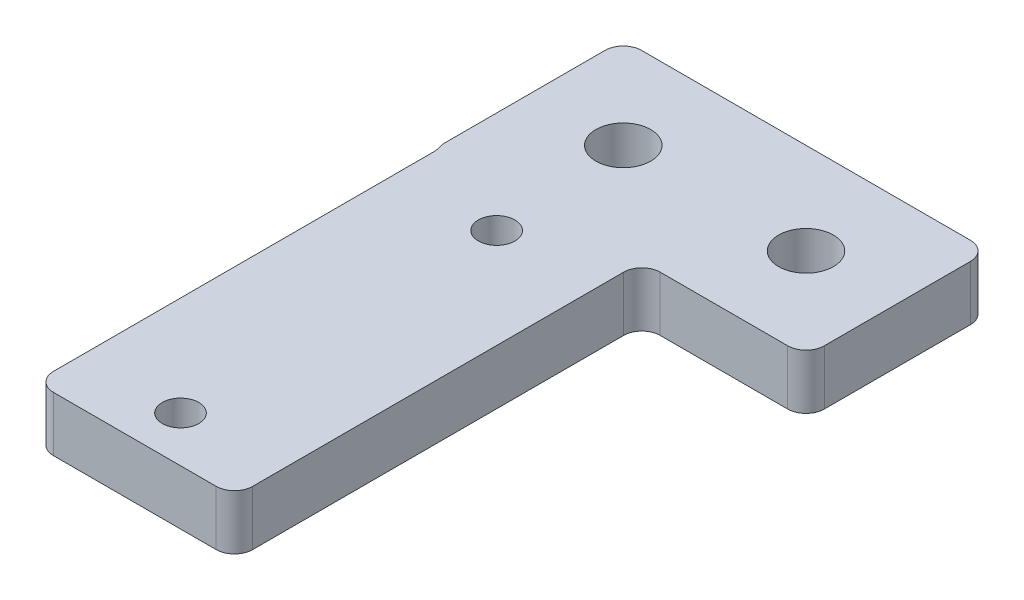
ISO-10303-21;
HEADER;
FILE_DESCRIPTION(('STEP AP214'),'2;1');
FILE_NAME('part.step','',(''),(''),'','','');
FILE_SCHEMA(('AUTOMOTIVE_DESIGN { 1 0 10303 214 1 1 1 1 }'));
ENDSEC;
DATA;
#1=APPLICATION_CONTEXT('core data for automotive mechanical design processes');
#2=APPLICATION_PROTOCOL_DEFINITION('international standard','automotive_design',2000,#1);
#3=PRODUCT_CONTEXT('',#1,'mechanical');
#4=PRODUCT('Part','Part','',(#3));
#5=PRODUCT_RELATED_PRODUCT_CATEGORY('part','',(#4));
#6=PRODUCT_DEFINITION_FORMATION('','',#4);
#7=PRODUCT_DEFINITION_CONTEXT('part definition',#1,'design');
#8=PRODUCT_DEFINITION('design','',#6,#7);
#9=PRODUCT_DEFINITION_SHAPE('','',#8);
#10=(LENGTH_UNIT() NAMED_UNIT(*) SI_UNIT(.MILLI.,.METRE.));
#11=(NAMED_UNIT(*) PLANE_ANGLE_UNIT() SI_UNIT($,.RADIAN.));
#12=(NAMED_UNIT(*) SI_UNIT($,.STERADIAN.) SOLID_ANGLE_UNIT());
#13=UNCERTAINTY_MEASURE_WITH_UNIT(LENGTH_MEASURE(1.E-05),#10,'distance_accuracy_value','');
#14=(GEOMETRIC_REPRESENTATION_CONTEXT(3) GLOBAL_UNCERTAINTY_ASSIGNED_CONTEXT((#13)) GLOBAL_UNIT_ASSIGNED_CONTEXT((#10,
#11,#12)) REPRESENTATION_CONTEXT('',''));
#15=CARTESIAN_POINT('',(0.,0.,0.));
#16=DIRECTION('',(0.,0.,1.));
#17=DIRECTION('',(1.,0.,0.));
#18=AXIS2_PLACEMENT_3D('',#15,#16,#17);
#19=CARTESIAN_POINT('',(11.02,3.,0.));
#20=DIRECTION('',(1.,0.,0.));
#21=DIRECTION('',(0.,0.,-1.));
#22=AXIS2_PLACEMENT_3D('',#19,#20,#21);
#23=PLANE('',#22);
#24=DIRECTION('',(0.,0.,1.));
#25=VECTOR('',#24,1.);
#26=CARTESIAN_POINT('',(11.02,0.,0.));
#27=LINE('',#26,#25);
#28=CARTESIAN_POINT('',(11.02,0.,1.));
#29=VERTEX_POINT('',#28);
#30=CARTESIAN_POINT('',(11.02,0.,21.3));
#31=VERTEX_POINT('',#30);
#32=EDGE_CURVE('E251',#29,#31,#27,.T.);
#33=ORIENTED_EDGE('',*,*,#32,.F.);
#34=DIRECTION('',(0.,-1.,0.));
#35=VECTOR('',#34,1.);
#36=CARTESIAN_POINT('',(11.02,3.,1.));
#37=LINE('',#36,#35);
#38=CARTESIAN_POINT('',(11.02,3.,1.));
#39=VERTEX_POINT('',#38);
#40=EDGE_CURVE('E206',#29,#39,#37,.F.);
#41=ORIENTED_EDGE('',*,*,#40,.T.);
#42=DIRECTION('',(0.,0.,1.));
#43=VECTOR('',#42,1.);
#44=CARTESIAN_POINT('',(11.02,3.,0.));
#45=LINE('',#44,#43);
#46=CARTESIAN_POINT('',(11.02,3.,21.3));
#47=VERTEX_POINT('',#46);
#48=EDGE_CURVE('E277',#39,#47,#45,.T.);
#49=ORIENTED_EDGE('',*,*,#48,.T.);
#50=DIRECTION('',(0.,-1.,0.));
#51=VECTOR('',#50,1.);
#52=CARTESIAN_POINT('',(11.02,0.,21.3));
#53=LINE('',#52,#51);
#54=EDGE_CURVE('E203',#47,#31,#53,.T.);
#55=ORIENTED_EDGE('',*,*,#54,.T.);
#56=EDGE_LOOP('',(#33,#41,#49,#55));
#57=FACE_BOUND('',#56,.T.);
#58=ADVANCED_FACE('F38',(#57),#23,.T.);
#59=CARTESIAN_POINT('',(0.,3.,0.));
#60=DIRECTION('',(0.,0.,-1.));
#61=DIRECTION('',(-1.,0.,0.));
#62=AXIS2_PLACEMENT_3D('',#59,#60,#61);
#63=PLANE('',#62);
#64=DIRECTION('',(1.,0.,0.));
#65=VECTOR('',#64,1.);
#66=CARTESIAN_POINT('',(0.,3.,0.));
#67=LINE('',#66,#65);
#68=CARTESIAN_POINT('',(12.02,3.,0.));
#69=VERTEX_POINT('',#68);
#70=CARTESIAN_POINT('',(19.,3.,0.));
#71=VERTEX_POINT('',#70);
#72=EDGE_CURVE('E274',#69,#71,#67,.T.);
#73=ORIENTED_EDGE('',*,*,#72,.F.);
#74=DIRECTION('',(0.,-1.,0.));
#75=VECTOR('',#74,1.);
#76=CARTESIAN_POINT('',(12.02,3.,0.));
#77=LINE('',#76,#75);
#78=CARTESIAN_POINT('',(12.02,0.,0.));
#79=VERTEX_POINT('',#78);
#80=EDGE_CURVE('E200',#69,#79,#77,.T.);
#81=ORIENTED_EDGE('',*,*,#80,.T.);
#82=DIRECTION('',(1.,0.,0.));
#83=VECTOR('',#82,1.);
#84=CARTESIAN_POINT('',(0.,0.,0.));
#85=LINE('',#84,#83);
#86=CARTESIAN_POINT('',(19.,0.,0.));
#87=VERTEX_POINT('',#86);
#88=EDGE_CURVE('E248',#79,#87,#85,.T.);
#89=ORIENTED_EDGE('',*,*,#88,.T.);
#90=DIRECTION('',(0.,-1.,0.));
#91=VECTOR('',#90,1.);
#92=CARTESIAN_POINT('',(19.,3.,0.));
#93=LINE('',#92,#91);
#94=EDGE_CURVE('E198',#87,#71,#93,.F.);
#95=ORIENTED_EDGE('',*,*,#94,.T.);
#96=EDGE_LOOP('',(#73,#81,#89,#95));
#97=FACE_BOUND('',#96,.T.);
#98=ADVANCED_FACE('F313',(#97),#63,.F.);
#99=CARTESIAN_POINT('',(20.,3.,0.));
#100=DIRECTION('',(-1.,0.,0.));
#101=DIRECTION('',(0.,0.,1.));
#102=AXIS2_PLACEMENT_3D('',#99,#100,#101);
#103=PLANE('',#102);
#104=DIRECTION('',(0.,0.,-1.));
#105=VECTOR('',#104,1.);
#106=CARTESIAN_POINT('',(20.,0.,0.));
#107=LINE('',#106,#105);
#108=CARTESIAN_POINT('',(20.,0.,-1.));
#109=VERTEX_POINT('',#108);
#110=CARTESIAN_POINT('',(20.,0.,-9.));
#111=VERTEX_POINT('',#110);
#112=EDGE_CURVE('E245',#109,#111,#107,.T.);
#113=ORIENTED_EDGE('',*,*,#112,.T.);
#114=DIRECTION('',(0.,-1.,0.));
#115=VECTOR('',#114,1.);
#116=CARTESIAN_POINT('',(20.,3.,-9.));
#117=LINE('',#116,#115);
#118=CARTESIAN_POINT('',(20.,3.,-9.));
#119=VERTEX_POINT('',#118);
#120=EDGE_CURVE('E196',#111,#119,#117,.F.);
#121=ORIENTED_EDGE('',*,*,#120,.T.);
#122=DIRECTION('',(0.,0.,-1.));
#123=VECTOR('',#122,1.);
#124=CARTESIAN_POINT('',(20.,3.,0.));
#125=LINE('',#124,#123);
#126=CARTESIAN_POINT('',(20.,3.,-1.));
#127=VERTEX_POINT('',#126);
#128=EDGE_CURVE('E271',#127,#119,#125,.T.);
#129=ORIENTED_EDGE('',*,*,#128,.F.);
#130=DIRECTION('',(0.,-1.,0.));
#131=VECTOR('',#130,1.);
#132=CARTESIAN_POINT('',(20.,3.,-1.));
#133=LINE('',#132,#131);
#134=EDGE_CURVE('E193',#127,#109,#133,.T.);
#135=ORIENTED_EDGE('',*,*,#134,.T.);
#136=EDGE_LOOP('',(#113,#121,#129,#135));
#137=FACE_BOUND('',#136,.T.);
#138=ADVANCED_FACE('F319',(#137),#103,.F.);
#139=CARTESIAN_POINT('',(0.,3.,-10.));
#140=DIRECTION('',(0.,0.,-1.));
#141=DIRECTION('',(-1.,0.,0.));
#142=AXIS2_PLACEMENT_3D('',#139,#140,#141);
#143=PLANE('',#142);
#144=DIRECTION('',(1.,0.,0.));
#145=VECTOR('',#144,1.);
#146=CARTESIAN_POINT('',(0.,0.,-10.));
#147=LINE('',#146,#145);
#148=CARTESIAN_POINT('',(1.,0.,-10.));
#149=VERTEX_POINT('',#148);
#150=CARTESIAN_POINT('',(19.,0.,-10.));
#151=VERTEX_POINT('',#150);
#152=EDGE_CURVE('E148',#149,#151,#147,.T.);
#153=ORIENTED_EDGE('',*,*,#152,.F.);
#154=DIRECTION('',(0.,-1.,0.));
#155=VECTOR('',#154,1.);
#156=CARTESIAN_POINT('',(1.,3.,-10.));
#157=LINE('',#156,#155);
#158=CARTESIAN_POINT('',(1.,3.,-10.));
#159=VERTEX_POINT('',#158);
#160=EDGE_CURVE('E156',#149,#159,#157,.F.);
#161=ORIENTED_EDGE('',*,*,#160,.T.);
#162=DIRECTION('',(1.,0.,0.));
#163=VECTOR('',#162,1.);
#164=CARTESIAN_POINT('',(0.,3.,-10.));
#165=LINE('',#164,#163);
#166=CARTESIAN_POINT('',(19.,3.,-10.));
#167=VERTEX_POINT('',#166);
#168=EDGE_CURVE('E268',#159,#167,#165,.T.);
#169=ORIENTED_EDGE('',*,*,#168,.T.);
#170=DIRECTION('',(0.,-1.,0.));
#171=VECTOR('',#170,1.);
#172=CARTESIAN_POINT('',(19.,0.,-10.));
#173=LINE('',#172,#171);
#174=EDGE_CURVE('E157',#167,#151,#173,.T.);
#175=ORIENTED_EDGE('',*,*,#174,.T.);
#176=EDGE_LOOP('',(#153,#161,#169,#175));
#177=FACE_BOUND('',#176,.T.);
#178=ADVANCED_FACE('F382',(#177),#143,.T.);
#179=CARTESIAN_POINT('',(0.,3.,0.));
#180=DIRECTION('',(-1.,0.,0.));
#181=DIRECTION('',(0.,0.,1.));
#182=AXIS2_PLACEMENT_3D('',#179,#180,#181);
#183=PLANE('',#182);
#184=DIRECTION('',(0.,0.,-1.));
#185=VECTOR('',#184,1.);
#186=CARTESIAN_POINT('',(0.,0.,0.));
#187=LINE('',#186,#185);
#188=CARTESIAN_POINT('',(0.,0.,-0.207375200887765));
#189=VERTEX_POINT('',#188);
#190=CARTESIAN_POINT('',(0.,0.,-9.));
#191=VERTEX_POINT('',#190);
#192=EDGE_CURVE('E140',#189,#191,#187,.T.);
#193=ORIENTED_EDGE('',*,*,#192,.F.);
#194=DIRECTION('',(0.,-1.,0.));
#195=VECTOR('',#194,1.);
#196=CARTESIAN_POINT('',(0.,3.,-0.207375200887765));
#197=LINE('',#196,#195);
#198=CARTESIAN_POINT('',(0.,3.,-0.207375200887765));
#199=VERTEX_POINT('',#198);
#200=EDGE_CURVE('E46',#189,#199,#197,.F.);
#201=ORIENTED_EDGE('',*,*,#200,.T.);
#202=DIRECTION('',(0.,0.,-1.));
#203=VECTOR('',#202,1.);
#204=CARTESIAN_POINT('',(0.,3.,0.));
#205=LINE('',#204,#203);
#206=CARTESIAN_POINT('',(0.,3.,-9.));
#207=VERTEX_POINT('',#206);
#208=EDGE_CURVE('E161',#199,#207,#205,.T.);
#209=ORIENTED_EDGE('',*,*,#208,.T.);
#210=DIRECTION('',(0.,-1.,0.));
#211=VECTOR('',#210,1.);
#212=CARTESIAN_POINT('',(0.,3.,-9.));
#213=LINE('',#212,#211);
#214=EDGE_CURVE('E155',#207,#191,#213,.T.);
#215=ORIENTED_EDGE('',*,*,#214,.T.);
#216=EDGE_LOOP('',(#193,#201,#209,#215));
#217=FACE_BOUND('',#216,.T.);
#218=ADVANCED_FACE('F160',(#217),#183,.T.);
#219=CARTESIAN_POINT('',(0.120000000000003,3.,0.));
#220=DIRECTION('',(1.,0.,0.));
#221=DIRECTION('',(0.,0.,-1.));
#222=AXIS2_PLACEMENT_3D('',#219,#220,#221);
#223=PLANE('',#222);
#224=DIRECTION('',(0.,0.,1.));
#225=VECTOR('',#224,1.);
#226=CARTESIAN_POINT('',(0.120000000000003,3.,0.));
#227=LINE('',#226,#225);
#228=CARTESIAN_POINT('',(0.120000000000003,3.,0.474973683481522));
#229=VERTEX_POINT('',#228);
#230=CARTESIAN_POINT('',(0.120000000000005,3.,21.3));
#231=VERTEX_POINT('',#230);
#232=EDGE_CURVE('E169',#229,#231,#227,.T.);
#233=ORIENTED_EDGE('',*,*,#232,.F.);
#234=DIRECTION('',(0.,1.,0.));
#235=VECTOR('',#234,1.);
#236=CARTESIAN_POINT('',(0.120000000000003,3.,0.474973683481522));
#237=LINE('',#236,#235);
#238=CARTESIAN_POINT('',(0.120000000000003,0.,0.474973683481522));
#239=VERTEX_POINT('',#238);
#240=EDGE_CURVE('E220',#229,#239,#237,.F.);
#241=ORIENTED_EDGE('',*,*,#240,.T.);
#242=DIRECTION('',(0.,0.,1.));
#243=VECTOR('',#242,1.);
#244=CARTESIAN_POINT('',(0.120000000000003,0.,0.));
#245=LINE('',#244,#243);
#246=CARTESIAN_POINT('',(0.120000000000005,0.,21.3));
#247=VERTEX_POINT('',#246);
#248=EDGE_CURVE('E147',#239,#247,#245,.T.);
#249=ORIENTED_EDGE('',*,*,#248,.T.);
#250=DIRECTION('',(0.,-1.,0.));
#251=VECTOR('',#250,1.);
#252=CARTESIAN_POINT('',(0.120000000000005,3.,21.3));
#253=LINE('',#252,#251);
#254=EDGE_CURVE('E213',#247,#231,#253,.F.);
#255=ORIENTED_EDGE('',*,*,#254,.T.);
#256=EDGE_LOOP('',(#233,#241,#249,#255));
#257=FACE_BOUND('',#256,.T.);
#258=ADVANCED_FACE('F329',(#257),#223,.F.);
#259=CARTESIAN_POINT('',(5.,3.,-5.));
#260=DIRECTION('',(0.,-1.,0.));
#261=DIRECTION('',(0.,0.,-1.));
#262=AXIS2_PLACEMENT_3D('',#259,#260,#261);
#263=CYLINDRICAL_SURFACE('',#262,1.5);
#264=CARTESIAN_POINT('',(5.,3.,-5.));
#265=DIRECTION('',(0.,1.,0.));
#266=DIRECTION('',(0.,0.,1.));
#267=AXIS2_PLACEMENT_3D('',#264,#265,#266);
#268=CIRCLE('',#267,1.5);
#269=CARTESIAN_POINT('',(5.,3.,-3.5));
#270=VERTEX_POINT('',#269);
#271=EDGE_CURVE('E280',#270,#270,#268,.T.);
#272=ORIENTED_EDGE('',*,*,#271,.T.);
#273=EDGE_LOOP('',(#272));
#274=FACE_BOUND('',#273,.T.);
#275=CARTESIAN_POINT('',(5.,0.,-5.));
#276=DIRECTION('',(0.,1.,0.));
#277=DIRECTION('',(0.,0.,1.));
#278=AXIS2_PLACEMENT_3D('',#275,#276,#277);
#279=CIRCLE('',#278,1.5);
#280=CARTESIAN_POINT('',(5.,0.,-3.5));
#281=VERTEX_POINT('',#280);
#282=EDGE_CURVE('E254',#281,#281,#279,.T.);
#283=ORIENTED_EDGE('',*,*,#282,.F.);
#284=EDGE_LOOP('',(#283));
#285=FACE_BOUND('',#284,.T.);
#286=ADVANCED_FACE('F325',(#274,#285),#263,.F.);
#287=CARTESIAN_POINT('',(15.,3.,-5.));
#288=DIRECTION('',(0.,-1.,0.));
#289=DIRECTION('',(0.,0.,-1.));
#290=AXIS2_PLACEMENT_3D('',#287,#288,#289);
#291=CYLINDRICAL_SURFACE('',#290,1.5);
#292=CARTESIAN_POINT('',(15.,3.,-5.));
#293=DIRECTION('',(0.,1.,0.));
#294=DIRECTION('',(0.,0.,1.));
#295=AXIS2_PLACEMENT_3D('',#292,#293,#294);
#296=CIRCLE('',#295,1.5);
#297=CARTESIAN_POINT('',(15.,3.,-3.5));
#298=VERTEX_POINT('',#297);
#299=EDGE_CURVE('E283',#298,#298,#296,.T.);
#300=ORIENTED_EDGE('',*,*,#299,.T.);
#301=EDGE_LOOP('',(#300));
#302=FACE_BOUND('',#301,.T.);
#303=CARTESIAN_POINT('',(15.,0.,-5.));
#304=DIRECTION('',(0.,1.,0.));
#305=DIRECTION('',(0.,0.,1.));
#306=AXIS2_PLACEMENT_3D('',#303,#304,#305);
#307=CIRCLE('',#306,1.5);
#308=CARTESIAN_POINT('',(15.,0.,-3.5));
#309=VERTEX_POINT('',#308);
#310=EDGE_CURVE('E257',#309,#309,#307,.T.);
#311=ORIENTED_EDGE('',*,*,#310,.F.);
#312=EDGE_LOOP('',(#311));
#313=FACE_BOUND('',#312,.T.);
#314=ADVANCED_FACE('F328',(#302,#313),#291,.F.);
#315=CARTESIAN_POINT('',(5.57,3.,2.5));
#316=DIRECTION('',(0.,-1.,0.));
#317=DIRECTION('',(0.,0.,-1.));
#318=AXIS2_PLACEMENT_3D('',#315,#316,#317);
#319=CYLINDRICAL_SURFACE('',#318,1.);
#320=CARTESIAN_POINT('',(5.57,3.,2.5));
#321=DIRECTION('',(0.,1.,0.));
#322=DIRECTION('',(0.,0.,1.));
#323=AXIS2_PLACEMENT_3D('',#320,#321,#322);
#324=CIRCLE('',#323,1.);
#325=CARTESIAN_POINT('',(5.57,3.,3.5));
#326=VERTEX_POINT('',#325);
#327=EDGE_CURVE('E286',#326,#326,#324,.T.);
#328=ORIENTED_EDGE('',*,*,#327,.T.);
#329=EDGE_LOOP('',(#328));
#330=FACE_BOUND('',#329,.T.);
#331=CARTESIAN_POINT('',(5.57,0.,2.5));
#332=DIRECTION('',(0.,1.,0.));
#333=DIRECTION('',(0.,0.,1.));
#334=AXIS2_PLACEMENT_3D('',#331,#332,#333);
#335=CIRCLE('',#334,1.);
#336=CARTESIAN_POINT('',(5.57,0.,3.5));
#337=VERTEX_POINT('',#336);
#338=EDGE_CURVE('E260',#337,#337,#335,.T.);
#339=ORIENTED_EDGE('',*,*,#338,.F.);
#340=EDGE_LOOP('',(#339));
#341=FACE_BOUND('',#340,.T.);
#342=ADVANCED_FACE('F333',(#330,#341),#319,.F.);
#343=CARTESIAN_POINT('',(5.57,3.,19.8));
#344=DIRECTION('',(0.,-1.,0.));
#345=DIRECTION('',(0.,0.,-1.));
#346=AXIS2_PLACEMENT_3D('',#343,#344,#345);
#347=CYLINDRICAL_SURFACE('',#346,1.);
#348=CARTESIAN_POINT('',(5.57,3.,19.8));
#349=DIRECTION('',(0.,1.,0.));
#350=DIRECTION('',(0.,0.,1.));
#351=AXIS2_PLACEMENT_3D('',#348,#349,#350);
#352=CIRCLE('',#351,1.);
#353=CARTESIAN_POINT('',(5.57,3.,20.8));
#354=VERTEX_POINT('',#353);
#355=EDGE_CURVE('E242',#354,#354,#352,.T.);
#356=ORIENTED_EDGE('',*,*,#355,.T.);
#357=EDGE_LOOP('',(#356));
#358=FACE_BOUND('',#357,.T.);
#359=CARTESIAN_POINT('',(5.57,0.,19.8));
#360=DIRECTION('',(0.,1.,0.));
#361=DIRECTION('',(0.,0.,1.));
#362=AXIS2_PLACEMENT_3D('',#359,#360,#361);
#363=CIRCLE('',#362,1.);
#364=CARTESIAN_POINT('',(5.57,0.,20.8));
#365=VERTEX_POINT('',#364);
#366=EDGE_CURVE('E263',#365,#365,#363,.T.);
#367=ORIENTED_EDGE('',*,*,#366,.F.);
#368=EDGE_LOOP('',(#367));
#369=FACE_BOUND('',#368,.T.);
#370=ADVANCED_FACE('F292',(#358,#369),#347,.F.);
#371=CARTESIAN_POINT('',(0.,3.,22.3));
#372=DIRECTION('',(0.,0.,-1.));
#373=DIRECTION('',(-1.,0.,0.));
#374=AXIS2_PLACEMENT_3D('',#371,#372,#373);
#375=PLANE('',#374);
#376=DIRECTION('',(1.,0.,0.));
#377=VECTOR('',#376,1.);
#378=CARTESIAN_POINT('',(0.,3.,22.3));
#379=LINE('',#378,#377);
#380=CARTESIAN_POINT('',(1.12000000000001,3.,22.3));
#381=VERTEX_POINT('',#380);
#382=CARTESIAN_POINT('',(10.02,3.,22.3));
#383=VERTEX_POINT('',#382);
#384=EDGE_CURVE('E164',#381,#383,#379,.T.);
#385=ORIENTED_EDGE('',*,*,#384,.F.);
#386=DIRECTION('',(0.,-1.,0.));
#387=VECTOR('',#386,1.);
#388=CARTESIAN_POINT('',(1.12000000000001,3.,22.3));
#389=LINE('',#388,#387);
#390=CARTESIAN_POINT('',(1.12000000000001,0.,22.3));
#391=VERTEX_POINT('',#390);
#392=EDGE_CURVE('E210',#381,#391,#389,.T.);
#393=ORIENTED_EDGE('',*,*,#392,.T.);
#394=DIRECTION('',(1.,0.,0.));
#395=VECTOR('',#394,1.);
#396=CARTESIAN_POINT('',(0.,0.,22.3));
#397=LINE('',#396,#395);
#398=CARTESIAN_POINT('',(10.02,0.,22.3));
#399=VERTEX_POINT('',#398);
#400=EDGE_CURVE('E172',#391,#399,#397,.T.);
#401=ORIENTED_EDGE('',*,*,#400,.T.);
#402=DIRECTION('',(0.,-1.,0.));
#403=VECTOR('',#402,1.);
#404=CARTESIAN_POINT('',(10.02,3.,22.3));
#405=LINE('',#404,#403);
#406=EDGE_CURVE('E208',#399,#383,#405,.F.);
#407=ORIENTED_EDGE('',*,*,#406,.T.);
#408=EDGE_LOOP('',(#385,#393,#401,#407));
#409=FACE_BOUND('',#408,.T.);
#410=ADVANCED_FACE('F298',(#409),#375,.F.);
#411=CARTESIAN_POINT('',(0.,3.,0.));
#412=DIRECTION('',(0.,1.,0.));
#413=DIRECTION('',(0.,0.,1.));
#414=AXIS2_PLACEMENT_3D('',#411,#412,#413);
#415=PLANE('',#414);
#416=ORIENTED_EDGE('',*,*,#355,.F.);
#417=EDGE_LOOP('',(#416));
#418=FACE_BOUND('',#417,.T.);
#419=ORIENTED_EDGE('',*,*,#327,.F.);
#420=EDGE_LOOP('',(#419));
#421=FACE_BOUND('',#420,.T.);
#422=ORIENTED_EDGE('',*,*,#299,.F.);
#423=EDGE_LOOP('',(#422));
#424=FACE_BOUND('',#423,.T.);
#425=ORIENTED_EDGE('',*,*,#271,.F.);
#426=EDGE_LOOP('',(#425));
#427=FACE_BOUND('',#426,.T.);
#428=ORIENTED_EDGE('',*,*,#208,.F.);
#429=CARTESIAN_POINT('',(1.,3.,-0.207375200887765));
#430=DIRECTION('',(0.,1.,0.));
#431=DIRECTION('',(0.,0.,1.));
#432=AXIS2_PLACEMENT_3D('',#429,#430,#431);
#433=CIRCLE('',#432,1.);
#434=CARTESIAN_POINT('',(0.0600000000000015,3.,0.133799241296878));
#435=VERTEX_POINT('',#434);
#436=EDGE_CURVE('E11',#199,#435,#433,.T.);
#437=ORIENTED_EDGE('',*,*,#436,.T.);
#438=CARTESIAN_POINT('',(-0.879999999999997,3.,0.474973683481522));
#439=DIRECTION('',(0.,1.,0.));
#440=DIRECTION('',(0.,0.,1.));
#441=AXIS2_PLACEMENT_3D('',#438,#439,#440);
#442=CIRCLE('',#441,1.);
#443=EDGE_CURVE('E225',#435,#229,#442,.F.);
#444=ORIENTED_EDGE('',*,*,#443,.T.);
#445=ORIENTED_EDGE('',*,*,#232,.T.);
#446=CARTESIAN_POINT('',(1.12000000000001,3.,21.3));
#447=DIRECTION('',(0.,1.,0.));
#448=DIRECTION('',(0.,0.,1.));
#449=AXIS2_PLACEMENT_3D('',#446,#447,#448);
#450=CIRCLE('',#449,1.);
#451=EDGE_CURVE('E185',#231,#381,#450,.T.);
#452=ORIENTED_EDGE('',*,*,#451,.T.);
#453=ORIENTED_EDGE('',*,*,#384,.T.);
#454=CARTESIAN_POINT('',(10.02,3.,21.3));
#455=DIRECTION('',(0.,1.,0.));
#456=DIRECTION('',(0.,0.,1.));
#457=AXIS2_PLACEMENT_3D('',#454,#455,#456);
#458=CIRCLE('',#457,1.);
#459=EDGE_CURVE('E183',#383,#47,#458,.T.);
#460=ORIENTED_EDGE('',*,*,#459,.T.);
#461=ORIENTED_EDGE('',*,*,#48,.F.);
#462=CARTESIAN_POINT('',(12.02,3.,1.));
#463=DIRECTION('',(0.,1.,0.));
#464=DIRECTION('',(0.,0.,1.));
#465=AXIS2_PLACEMENT_3D('',#462,#463,#464);
#466=CIRCLE('',#465,1.);
#467=EDGE_CURVE('E218',#39,#69,#466,.F.);
#468=ORIENTED_EDGE('',*,*,#467,.T.);
#469=ORIENTED_EDGE('',*,*,#72,.T.);
#470=CARTESIAN_POINT('',(19.,3.,-1.));
#471=DIRECTION('',(0.,1.,0.));
#472=DIRECTION('',(0.,0.,1.));
#473=AXIS2_PLACEMENT_3D('',#470,#471,#472);
#474=CIRCLE('',#473,1.);
#475=EDGE_CURVE('E187',#71,#127,#474,.T.);
#476=ORIENTED_EDGE('',*,*,#475,.T.);
#477=ORIENTED_EDGE('',*,*,#128,.T.);
#478=CARTESIAN_POINT('',(19.,3.,-9.));
#479=DIRECTION('',(0.,1.,0.));
#480=DIRECTION('',(0.,0.,1.));
#481=AXIS2_PLACEMENT_3D('',#478,#479,#480);
#482=CIRCLE('',#481,1.);
#483=EDGE_CURVE('E189',#119,#167,#482,.T.);
#484=ORIENTED_EDGE('',*,*,#483,.T.);
#485=ORIENTED_EDGE('',*,*,#168,.F.);
#486=CARTESIAN_POINT('',(1.,3.,-9.));
#487=DIRECTION('',(0.,1.,0.));
#488=DIRECTION('',(0.,0.,1.));
#489=AXIS2_PLACEMENT_3D('',#486,#487,#488);
#490=CIRCLE('',#489,1.);
#491=EDGE_CURVE('E191',#159,#207,#490,.T.);
#492=ORIENTED_EDGE('',*,*,#491,.T.);
#493=EDGE_LOOP('',(#428,#437,#444,#445,#452,#453,#460,#461,#468,#469,#476,#477,#484,#485,#492));
#494=FACE_BOUND('',#493,.T.);
#495=ADVANCED_FACE('F295',(#418,#421,#424,#427,#494),#415,.T.);
#496=CARTESIAN_POINT('',(0.,0.,0.));
#497=DIRECTION('',(0.,1.,0.));
#498=DIRECTION('',(0.,0.,1.));
#499=AXIS2_PLACEMENT_3D('',#496,#497,#498);
#500=PLANE('',#499);
#501=ORIENTED_EDGE('',*,*,#366,.T.);
#502=EDGE_LOOP('',(#501));
#503=FACE_BOUND('',#502,.T.);
#504=ORIENTED_EDGE('',*,*,#338,.T.);
#505=EDGE_LOOP('',(#504));
#506=FACE_BOUND('',#505,.T.);
#507=ORIENTED_EDGE('',*,*,#310,.T.);
#508=EDGE_LOOP('',(#507));
#509=FACE_BOUND('',#508,.T.);
#510=ORIENTED_EDGE('',*,*,#282,.T.);
#511=EDGE_LOOP('',(#510));
#512=FACE_BOUND('',#511,.T.);
#513=CARTESIAN_POINT('',(-0.879999999999997,0.,0.474973683481522));
#514=DIRECTION('',(0.,1.,0.));
#515=DIRECTION('',(0.,0.,1.));
#516=AXIS2_PLACEMENT_3D('',#513,#514,#515);
#517=CIRCLE('',#516,1.);
#518=CARTESIAN_POINT('',(0.0600000000000015,0.,0.133799241296878));
#519=VERTEX_POINT('',#518);
#520=EDGE_CURVE('E223',#239,#519,#517,.T.);
#521=ORIENTED_EDGE('',*,*,#520,.T.);
#522=CARTESIAN_POINT('',(1.,0.,-0.207375200887765));
#523=DIRECTION('',(0.,1.,0.));
#524=DIRECTION('',(0.,0.,1.));
#525=AXIS2_PLACEMENT_3D('',#522,#523,#524);
#526=CIRCLE('',#525,1.);
#527=EDGE_CURVE('E60',#519,#189,#526,.F.);
#528=ORIENTED_EDGE('',*,*,#527,.T.);
#529=ORIENTED_EDGE('',*,*,#192,.T.);
#530=CARTESIAN_POINT('',(1.,0.,-9.));
#531=DIRECTION('',(0.,1.,0.));
#532=DIRECTION('',(0.,0.,1.));
#533=AXIS2_PLACEMENT_3D('',#530,#531,#532);
#534=CIRCLE('',#533,1.);
#535=EDGE_CURVE('E144',#191,#149,#534,.F.);
#536=ORIENTED_EDGE('',*,*,#535,.T.);
#537=ORIENTED_EDGE('',*,*,#152,.T.);
#538=CARTESIAN_POINT('',(19.,0.,-9.));
#539=DIRECTION('',(0.,1.,0.));
#540=DIRECTION('',(0.,0.,1.));
#541=AXIS2_PLACEMENT_3D('',#538,#539,#540);
#542=CIRCLE('',#541,1.);
#543=EDGE_CURVE('E158',#151,#111,#542,.F.);
#544=ORIENTED_EDGE('',*,*,#543,.T.);
#545=ORIENTED_EDGE('',*,*,#112,.F.);
#546=CARTESIAN_POINT('',(19.,0.,-1.));
#547=DIRECTION('',(0.,1.,0.));
#548=DIRECTION('',(0.,0.,1.));
#549=AXIS2_PLACEMENT_3D('',#546,#547,#548);
#550=CIRCLE('',#549,1.);
#551=EDGE_CURVE('E177',#109,#87,#550,.F.);
#552=ORIENTED_EDGE('',*,*,#551,.T.);
#553=ORIENTED_EDGE('',*,*,#88,.F.);
#554=CARTESIAN_POINT('',(12.02,0.,1.));
#555=DIRECTION('',(0.,1.,0.));
#556=DIRECTION('',(0.,0.,1.));
#557=AXIS2_PLACEMENT_3D('',#554,#555,#556);
#558=CIRCLE('',#557,1.);
#559=EDGE_CURVE('E216',#79,#29,#558,.T.);
#560=ORIENTED_EDGE('',*,*,#559,.T.);
#561=ORIENTED_EDGE('',*,*,#32,.T.);
#562=CARTESIAN_POINT('',(10.02,0.,21.3));
#563=DIRECTION('',(0.,1.,0.));
#564=DIRECTION('',(0.,0.,1.));
#565=AXIS2_PLACEMENT_3D('',#562,#563,#564);
#566=CIRCLE('',#565,1.);
#567=EDGE_CURVE('E163',#31,#399,#566,.F.);
#568=ORIENTED_EDGE('',*,*,#567,.T.);
#569=ORIENTED_EDGE('',*,*,#400,.F.);
#570=CARTESIAN_POINT('',(1.12000000000001,0.,21.3));
#571=DIRECTION('',(0.,1.,0.));
#572=DIRECTION('',(0.,0.,1.));
#573=AXIS2_PLACEMENT_3D('',#570,#571,#572);
#574=CIRCLE('',#573,1.);
#575=EDGE_CURVE('E166',#391,#247,#574,.F.);
#576=ORIENTED_EDGE('',*,*,#575,.T.);
#577=ORIENTED_EDGE('',*,*,#248,.F.);
#578=EDGE_LOOP('',(#521,#528,#529,#536,#537,#544,#545,#552,#553,#560,#561,#568,#569,#576,#577));
#579=FACE_BOUND('',#578,.T.);
#580=ADVANCED_FACE('F142',(#503,#506,#509,#512,#579),#500,.F.);
#581=CARTESIAN_POINT('',(1.,3.,-9.));
#582=DIRECTION('',(0.,-1.,0.));
#583=DIRECTION('',(0.,0.,-1.));
#584=AXIS2_PLACEMENT_3D('',#581,#582,#583);
#585=CYLINDRICAL_SURFACE('',#584,1.);
#586=ORIENTED_EDGE('',*,*,#491,.F.);
#587=ORIENTED_EDGE('',*,*,#160,.F.);
#588=ORIENTED_EDGE('',*,*,#535,.F.);
#589=ORIENTED_EDGE('',*,*,#214,.F.);
#590=EDGE_LOOP('',(#586,#587,#588,#589));
#591=FACE_BOUND('',#590,.T.);
#592=ADVANCED_FACE('F154',(#591),#585,.T.);
#593=CARTESIAN_POINT('',(19.,3.,-9.));
#594=DIRECTION('',(0.,1.,0.));
#595=DIRECTION('',(0.,0.,1.));
#596=AXIS2_PLACEMENT_3D('',#593,#594,#595);
#597=CYLINDRICAL_SURFACE('',#596,1.);
#598=ORIENTED_EDGE('',*,*,#483,.F.);
#599=ORIENTED_EDGE('',*,*,#120,.F.);
#600=ORIENTED_EDGE('',*,*,#543,.F.);
#601=ORIENTED_EDGE('',*,*,#174,.F.);
#602=EDGE_LOOP('',(#598,#599,#600,#601));
#603=FACE_BOUND('',#602,.T.);
#604=ADVANCED_FACE('F342',(#603),#597,.T.);
#605=CARTESIAN_POINT('',(12.02,3.,1.));
#606=DIRECTION('',(0.,-1.,0.));
#607=DIRECTION('',(0.,0.,-1.));
#608=AXIS2_PLACEMENT_3D('',#605,#606,#607);
#609=CYLINDRICAL_SURFACE('',#608,1.);
#610=ORIENTED_EDGE('',*,*,#467,.F.);
#611=ORIENTED_EDGE('',*,*,#40,.F.);
#612=ORIENTED_EDGE('',*,*,#559,.F.);
#613=ORIENTED_EDGE('',*,*,#80,.F.);
#614=EDGE_LOOP('',(#610,#611,#612,#613));
#615=FACE_BOUND('',#614,.T.);
#616=ADVANCED_FACE('F345',(#615),#609,.F.);
#617=CARTESIAN_POINT('',(19.,3.,-1.));
#618=DIRECTION('',(0.,-1.,0.));
#619=DIRECTION('',(0.,0.,-1.));
#620=AXIS2_PLACEMENT_3D('',#617,#618,#619);
#621=CYLINDRICAL_SURFACE('',#620,1.);
#622=ORIENTED_EDGE('',*,*,#475,.F.);
#623=ORIENTED_EDGE('',*,*,#94,.F.);
#624=ORIENTED_EDGE('',*,*,#551,.F.);
#625=ORIENTED_EDGE('',*,*,#134,.F.);
#626=EDGE_LOOP('',(#622,#623,#624,#625));
#627=FACE_BOUND('',#626,.T.);
#628=ADVANCED_FACE('F349',(#627),#621,.T.);
#629=CARTESIAN_POINT('',(1.12000000000001,3.,21.3));
#630=DIRECTION('',(0.,-1.,0.));
#631=DIRECTION('',(0.,0.,-1.));
#632=AXIS2_PLACEMENT_3D('',#629,#630,#631);
#633=CYLINDRICAL_SURFACE('',#632,1.);
#634=ORIENTED_EDGE('',*,*,#451,.F.);
#635=ORIENTED_EDGE('',*,*,#254,.F.);
#636=ORIENTED_EDGE('',*,*,#575,.F.);
#637=ORIENTED_EDGE('',*,*,#392,.F.);
#638=EDGE_LOOP('',(#634,#635,#636,#637));
#639=FACE_BOUND('',#638,.T.);
#640=ADVANCED_FACE('F353',(#639),#633,.T.);
#641=CARTESIAN_POINT('',(10.02,3.,21.3));
#642=DIRECTION('',(0.,1.,0.));
#643=DIRECTION('',(0.,0.,1.));
#644=AXIS2_PLACEMENT_3D('',#641,#642,#643);
#645=CYLINDRICAL_SURFACE('',#644,1.);
#646=ORIENTED_EDGE('',*,*,#459,.F.);
#647=ORIENTED_EDGE('',*,*,#406,.F.);
#648=ORIENTED_EDGE('',*,*,#567,.F.);
#649=ORIENTED_EDGE('',*,*,#54,.F.);
#650=EDGE_LOOP('',(#646,#647,#648,#649));
#651=FACE_BOUND('',#650,.T.);
#652=ADVANCED_FACE('F311',(#651),#645,.T.);
#653=CARTESIAN_POINT('',(-0.879999999999997,3.,0.474973683481522));
#654=DIRECTION('',(0.,1.,0.));
#655=DIRECTION('',(0.,0.,1.));
#656=AXIS2_PLACEMENT_3D('',#653,#654,#655);
#657=CYLINDRICAL_SURFACE('',#656,1.);
#658=ORIENTED_EDGE('',*,*,#443,.F.);
#659=DIRECTION('',(0.,1.,0.));
#660=VECTOR('',#659,1.);
#661=CARTESIAN_POINT('',(0.0600000000000015,3.,0.133799241296878));
#662=LINE('',#661,#660);
#663=EDGE_CURVE('E227',#435,#519,#662,.F.);
#664=ORIENTED_EDGE('',*,*,#663,.T.);
#665=ORIENTED_EDGE('',*,*,#520,.F.);
#666=ORIENTED_EDGE('',*,*,#240,.F.);
#667=EDGE_LOOP('',(#658,#664,#665,#666));
#668=FACE_BOUND('',#667,.T.);
#669=ADVANCED_FACE('F233',(#668),#657,.F.);
#670=CARTESIAN_POINT('',(1.,3.,-0.207375200887765));
#671=DIRECTION('',(0.,1.,0.));
#672=DIRECTION('',(0.,0.,1.));
#673=AXIS2_PLACEMENT_3D('',#670,#671,#672);
#674=CYLINDRICAL_SURFACE('',#673,1.);
#675=ORIENTED_EDGE('',*,*,#436,.F.);
#676=ORIENTED_EDGE('',*,*,#200,.F.);
#677=ORIENTED_EDGE('',*,*,#527,.F.);
#678=ORIENTED_EDGE('',*,*,#663,.F.);
#679=EDGE_LOOP('',(#675,#676,#677,#678));
#680=FACE_BOUND('',#679,.T.);
#681=ADVANCED_FACE('F40',(#680),#674,.T.);
#682=CLOSED_SHELL('',(#58,#98,#138,#178,#218,#258,#286,#314,#342,#370,#410,#495,#580,#592,#604,
#616,#628,#640,#652,#669,#681));
#683=MANIFOLD_SOLID_BREP('B2',#682);
#684=ADVANCED_BREP_SHAPE_REPRESENTATION('',(#18,#683),#14);
#685=SHAPE_DEFINITION_REPRESENTATION(#9,#684);
ENDSEC;
END-ISO-10303-21;
